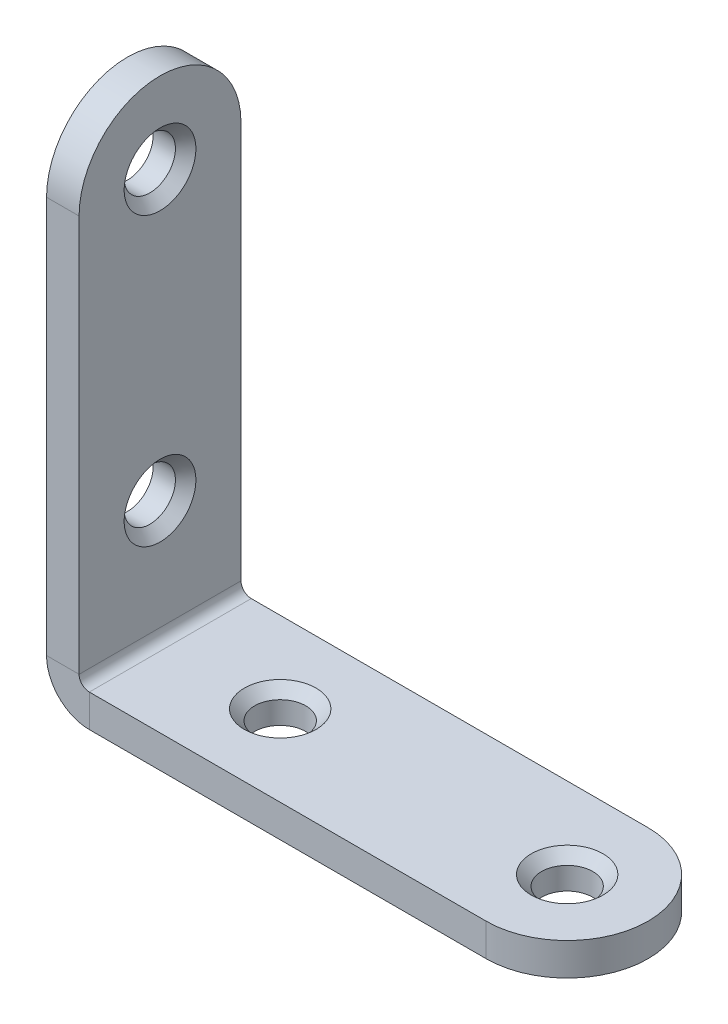
ISO-10303-21;
HEADER;
FILE_DESCRIPTION(('STEP AP214'),'2;1');
FILE_NAME('part.step','',(''),(''),'','','');
FILE_SCHEMA(('AUTOMOTIVE_DESIGN { 1 0 10303 214 1 1 1 1 }'));
ENDSEC;
DATA;
#1=APPLICATION_CONTEXT('core data for automotive mechanical design processes');
#2=APPLICATION_PROTOCOL_DEFINITION('international standard','automotive_design',2000,#1);
#3=PRODUCT_CONTEXT('',#1,'mechanical');
#4=PRODUCT('Part','Part','',(#3));
#5=PRODUCT_RELATED_PRODUCT_CATEGORY('part','',(#4));
#6=PRODUCT_DEFINITION_FORMATION('','',#4);
#7=PRODUCT_DEFINITION_CONTEXT('part definition',#1,'design');
#8=PRODUCT_DEFINITION('design','',#6,#7);
#9=PRODUCT_DEFINITION_SHAPE('','',#8);
#10=(LENGTH_UNIT() NAMED_UNIT(*) SI_UNIT(.MILLI.,.METRE.));
#11=(NAMED_UNIT(*) PLANE_ANGLE_UNIT() SI_UNIT($,.RADIAN.));
#12=(NAMED_UNIT(*) SI_UNIT($,.STERADIAN.) SOLID_ANGLE_UNIT());
#13=UNCERTAINTY_MEASURE_WITH_UNIT(LENGTH_MEASURE(1.E-05),#10,'distance_accuracy_value','');
#14=(GEOMETRIC_REPRESENTATION_CONTEXT(3) GLOBAL_UNCERTAINTY_ASSIGNED_CONTEXT((#13)) GLOBAL_UNIT_ASSIGNED_CONTEXT((#10,
#11,#12)) REPRESENTATION_CONTEXT('',''));
#15=CARTESIAN_POINT('',(0.,0.,0.));
#16=DIRECTION('',(0.,0.,1.));
#17=DIRECTION('',(1.,0.,0.));
#18=AXIS2_PLACEMENT_3D('',#15,#16,#17);
#19=CARTESIAN_POINT('',(42.8999999999999,3.10862446895044E-12,0.));
#20=DIRECTION('',(0.,-1.,0.));
#21=DIRECTION('',(0.,0.,-1.));
#22=AXIS2_PLACEMENT_3D('',#19,#20,#21);
#23=CYLINDRICAL_SURFACE('',#22,7.9);
#24=DIRECTION('',(0.,-1.,0.));
#25=VECTOR('',#24,1.);
#26=CARTESIAN_POINT('',(42.9000000000015,4.17500000000148,7.90000000000001));
#27=LINE('',#26,#25);
#28=CARTESIAN_POINT('',(42.8999999999999,3.10862446895044E-12,7.89999999999998));
#29=VERTEX_POINT('',#28);
#30=CARTESIAN_POINT('',(42.9000000000015,3.17500000000148,7.90000000000005));
#31=VERTEX_POINT('',#30);
#32=EDGE_CURVE('E145',#29,#31,#27,.F.);
#33=ORIENTED_EDGE('',*,*,#32,.F.);
#34=CARTESIAN_POINT('',(42.8999999999999,3.10862446895044E-12,0.));
#35=DIRECTION('',(0.,1.,0.));
#36=DIRECTION('',(0.,0.,1.));
#37=AXIS2_PLACEMENT_3D('',#34,#35,#36);
#38=CIRCLE('',#37,7.9);
#39=CARTESIAN_POINT('',(42.8999999999999,1.55431223447522E-12,-7.90000000000003));
#40=VERTEX_POINT('',#39);
#41=EDGE_CURVE('E70',#40,#29,#38,.F.);
#42=ORIENTED_EDGE('',*,*,#41,.F.);
#43=DIRECTION('',(0.,-1.,0.));
#44=VECTOR('',#43,1.);
#45=CARTESIAN_POINT('',(42.9000000000015,4.17500000000148,-7.89999999999999));
#46=LINE('',#45,#44);
#47=CARTESIAN_POINT('',(42.9000000000015,3.17500000000148,-7.89999999999995));
#48=VERTEX_POINT('',#47);
#49=EDGE_CURVE('E219',#48,#40,#46,.T.);
#50=ORIENTED_EDGE('',*,*,#49,.F.);
#51=CARTESIAN_POINT('',(42.9000000000015,3.17500000000148,0.));
#52=DIRECTION('',(0.,1.,0.));
#53=DIRECTION('',(0.,0.,1.));
#54=AXIS2_PLACEMENT_3D('',#51,#52,#53);
#55=CIRCLE('',#54,7.9);
#56=EDGE_CURVE('E63',#31,#48,#55,.T.);
#57=ORIENTED_EDGE('',*,*,#56,.F.);
#58=EDGE_LOOP('',(#33,#42,#50,#57));
#59=FACE_BOUND('',#58,.T.);
#60=ADVANCED_FACE('F46',(#59),#23,.T.);
#61=CARTESIAN_POINT('',(3.17499999999771,42.9,0.));
#62=DIRECTION('',(1.,0.,0.));
#63=DIRECTION('',(0.,0.,-1.));
#64=AXIS2_PLACEMENT_3D('',#61,#62,#63);
#65=CYLINDRICAL_SURFACE('',#64,7.9);
#66=DIRECTION('',(1.,0.,0.));
#67=VECTOR('',#66,1.);
#68=CARTESIAN_POINT('',(4.17499999999771,42.9,7.90000000000001));
#69=LINE('',#68,#67);
#70=CARTESIAN_POINT('',(3.17499999999771,42.9,7.90000000000005));
#71=VERTEX_POINT('',#70);
#72=CARTESIAN_POINT('',(-2.33146835171283E-12,42.9,7.90000000000005));
#73=VERTEX_POINT('',#72);
#74=EDGE_CURVE('E203',#71,#73,#69,.F.);
#75=ORIENTED_EDGE('',*,*,#74,.F.);
#76=CARTESIAN_POINT('',(3.17499999999771,42.9,0.));
#77=DIRECTION('',(1.,0.,0.));
#78=DIRECTION('',(0.,0.,-1.));
#79=AXIS2_PLACEMENT_3D('',#76,#77,#78);
#80=CIRCLE('',#79,7.9);
#81=CARTESIAN_POINT('',(3.17499999999771,42.9,-7.89999999999995));
#82=VERTEX_POINT('',#81);
#83=EDGE_CURVE('E211',#82,#71,#80,.T.);
#84=ORIENTED_EDGE('',*,*,#83,.F.);
#85=DIRECTION('',(-1.,0.,0.));
#86=VECTOR('',#85,1.);
#87=CARTESIAN_POINT('',(3.17499999999771,42.9,-7.89999999999995));
#88=LINE('',#87,#86);
#89=CARTESIAN_POINT('',(-2.33146835171283E-12,42.9,-7.89999999999995));
#90=VERTEX_POINT('',#89);
#91=EDGE_CURVE('E207',#90,#82,#88,.F.);
#92=ORIENTED_EDGE('',*,*,#91,.F.);
#93=CARTESIAN_POINT('',(-2.33146835171283E-12,42.9,0.));
#94=DIRECTION('',(1.,0.,0.));
#95=DIRECTION('',(0.,0.,-1.));
#96=AXIS2_PLACEMENT_3D('',#93,#94,#95);
#97=CIRCLE('',#96,7.9);
#98=EDGE_CURVE('E214',#73,#90,#97,.F.);
#99=ORIENTED_EDGE('',*,*,#98,.F.);
#100=EDGE_LOOP('',(#75,#84,#92,#99));
#101=FACE_BOUND('',#100,.T.);
#102=ADVANCED_FACE('F313',(#101),#65,.T.);
#103=CARTESIAN_POINT('',(1.55431223447522E-12,4.17500000000004,7.90000000000009));
#104=DIRECTION('',(0.,0.,1.));
#105=DIRECTION('',(1.,0.,0.));
#106=AXIS2_PLACEMENT_3D('',#103,#104,#105);
#107=PLANE('',#106);
#108=DIRECTION('',(1.,0.,0.));
#109=VECTOR('',#108,1.);
#110=CARTESIAN_POINT('',(1.55431223447522E-12,4.17500000000004,7.90000000000009));
#111=LINE('',#110,#109);
#112=CARTESIAN_POINT('',(1.55431223447522E-12,4.17500000000004,7.90000000000009));
#113=VERTEX_POINT('',#112);
#114=CARTESIAN_POINT('',(3.17500000000159,4.17500000000004,7.9));
#115=VERTEX_POINT('',#114);
#116=EDGE_CURVE('E127',#113,#115,#111,.T.);
#117=ORIENTED_EDGE('',*,*,#116,.F.);
#118=CARTESIAN_POINT('',(4.17500000000159,4.17500000000004,7.89999999999998));
#119=DIRECTION('',(0.,0.,-1.));
#120=DIRECTION('',(-1.,0.,0.));
#121=AXIS2_PLACEMENT_3D('',#118,#119,#120);
#122=CIRCLE('',#121,4.175);
#123=CARTESIAN_POINT('',(4.17500000000004,0.,7.90000000000012));
#124=VERTEX_POINT('',#123);
#125=EDGE_CURVE('E121',#113,#124,#122,.F.);
#126=ORIENTED_EDGE('',*,*,#125,.T.);
#127=DIRECTION('',(0.,-1.,0.));
#128=VECTOR('',#127,1.);
#129=CARTESIAN_POINT('',(4.17500000000159,3.17500000000004,7.9));
#130=LINE('',#129,#128);
#131=CARTESIAN_POINT('',(4.17500000000159,3.17500000000004,7.9));
#132=VERTEX_POINT('',#131);
#133=EDGE_CURVE('E114',#132,#124,#130,.T.);
#134=ORIENTED_EDGE('',*,*,#133,.F.);
#135=CARTESIAN_POINT('',(4.17500000000159,4.17500000000004,7.89999999999998));
#136=DIRECTION('',(0.,0.,1.));
#137=DIRECTION('',(1.,0.,0.));
#138=AXIS2_PLACEMENT_3D('',#135,#136,#137);
#139=CIRCLE('',#138,1.);
#140=EDGE_CURVE('E119',#115,#132,#139,.T.);
#141=ORIENTED_EDGE('',*,*,#140,.F.);
#142=EDGE_LOOP('',(#117,#126,#134,#141));
#143=FACE_BOUND('',#142,.T.);
#144=ADVANCED_FACE('F117',(#143),#107,.T.);
#145=CARTESIAN_POINT('',(4.17500000000159,3.17500000000004,7.9));
#146=DIRECTION('',(0.,0.,1.));
#147=DIRECTION('',(1.,0.,0.));
#148=AXIS2_PLACEMENT_3D('',#145,#146,#147);
#149=PLANE('',#148);
#150=DIRECTION('',(0.,1.,0.));
#151=VECTOR('',#150,1.);
#152=CARTESIAN_POINT('',(3.17500000000004,0.,7.89999999999998));
#153=LINE('',#152,#151);
#154=EDGE_CURVE('E153',#71,#115,#153,.F.);
#155=ORIENTED_EDGE('',*,*,#154,.F.);
#156=ORIENTED_EDGE('',*,*,#74,.T.);
#157=DIRECTION('',(0.,-1.,0.));
#158=VECTOR('',#157,1.);
#159=CARTESIAN_POINT('',(0.,0.,7.90000000000001));
#160=LINE('',#159,#158);
#161=EDGE_CURVE('E157',#73,#113,#160,.T.);
#162=ORIENTED_EDGE('',*,*,#161,.T.);
#163=ORIENTED_EDGE('',*,*,#116,.T.);
#164=EDGE_LOOP('',(#155,#156,#162,#163));
#165=FACE_BOUND('',#164,.T.);
#166=ADVANCED_FACE('F311',(#165),#149,.T.);
#167=CARTESIAN_POINT('',(4.17500000000004,-1.55431223447522E-12,-7.89999999999988));
#168=DIRECTION('',(0.,0.,-1.));
#169=DIRECTION('',(-1.,0.,0.));
#170=AXIS2_PLACEMENT_3D('',#167,#168,#169);
#171=PLANE('',#170);
#172=DIRECTION('',(0.,1.,0.));
#173=VECTOR('',#172,1.);
#174=CARTESIAN_POINT('',(4.17500000000004,-1.55431223447522E-12,-7.89999999999988));
#175=LINE('',#174,#173);
#176=CARTESIAN_POINT('',(4.17500000000004,-1.55431223447522E-12,-7.89999999999988));
#177=VERTEX_POINT('',#176);
#178=CARTESIAN_POINT('',(4.17500000000159,3.17500000000004,-7.9));
#179=VERTEX_POINT('',#178);
#180=EDGE_CURVE('E128',#177,#179,#175,.T.);
#181=ORIENTED_EDGE('',*,*,#180,.F.);
#182=CARTESIAN_POINT('',(4.17500000000159,4.17500000000004,-7.90000000000003));
#183=DIRECTION('',(0.,0.,-1.));
#184=DIRECTION('',(-1.,0.,0.));
#185=AXIS2_PLACEMENT_3D('',#182,#183,#184);
#186=CIRCLE('',#185,4.175);
#187=CARTESIAN_POINT('',(1.55431223447522E-12,4.17500000000004,-7.89999999999992));
#188=VERTEX_POINT('',#187);
#189=EDGE_CURVE('E182',#188,#177,#186,.F.);
#190=ORIENTED_EDGE('',*,*,#189,.F.);
#191=DIRECTION('',(-1.,0.,0.));
#192=VECTOR('',#191,1.);
#193=CARTESIAN_POINT('',(3.17500000000159,4.17500000000004,-7.9));
#194=LINE('',#193,#192);
#195=CARTESIAN_POINT('',(3.17500000000159,4.17500000000004,-7.9));
#196=VERTEX_POINT('',#195);
#197=EDGE_CURVE('E140',#196,#188,#194,.T.);
#198=ORIENTED_EDGE('',*,*,#197,.F.);
#199=CARTESIAN_POINT('',(4.17500000000159,4.17500000000004,-7.90000000000003));
#200=DIRECTION('',(0.,0.,1.));
#201=DIRECTION('',(1.,0.,0.));
#202=AXIS2_PLACEMENT_3D('',#199,#200,#201);
#203=CIRCLE('',#202,1.);
#204=EDGE_CURVE('E173',#196,#179,#203,.T.);
#205=ORIENTED_EDGE('',*,*,#204,.T.);
#206=EDGE_LOOP('',(#181,#190,#198,#205));
#207=FACE_BOUND('',#206,.T.);
#208=ADVANCED_FACE('F294',(#207),#171,.T.);
#209=CARTESIAN_POINT('',(3.17500000000159,4.17500000000004,-7.9));
#210=DIRECTION('',(0.,0.,-1.));
#211=DIRECTION('',(-1.,0.,0.));
#212=AXIS2_PLACEMENT_3D('',#209,#210,#211);
#213=PLANE('',#212);
#214=DIRECTION('',(1.,0.,0.));
#215=VECTOR('',#214,1.);
#216=CARTESIAN_POINT('',(1.55431223447522E-12,3.17500000000004,-7.89999999999995));
#217=LINE('',#216,#215);
#218=EDGE_CURVE('E135',#179,#48,#217,.T.);
#219=ORIENTED_EDGE('',*,*,#218,.T.);
#220=ORIENTED_EDGE('',*,*,#49,.T.);
#221=DIRECTION('',(1.,0.,0.));
#222=VECTOR('',#221,1.);
#223=CARTESIAN_POINT('',(0.,0.,-7.89999999999999));
#224=LINE('',#223,#222);
#225=EDGE_CURVE('E166',#177,#40,#224,.T.);
#226=ORIENTED_EDGE('',*,*,#225,.F.);
#227=ORIENTED_EDGE('',*,*,#180,.T.);
#228=EDGE_LOOP('',(#219,#220,#226,#227));
#229=FACE_BOUND('',#228,.T.);
#230=ADVANCED_FACE('F291',(#229),#213,.T.);
#231=CARTESIAN_POINT('',(0.,0.,7.90000000000001));
#232=DIRECTION('',(0.,1.,0.));
#233=DIRECTION('',(0.,0.,1.));
#234=AXIS2_PLACEMENT_3D('',#231,#232,#233);
#235=PLANE('',#234);
#236=CARTESIAN_POINT('',(42.8999999999999,3.10862446895044E-12,0.));
#237=DIRECTION('',(0.,1.,0.));
#238=DIRECTION('',(0.,0.,1.));
#239=AXIS2_PLACEMENT_3D('',#236,#237,#238);
#240=CIRCLE('',#239,2.5);
#241=CARTESIAN_POINT('',(42.8999999999999,3.10862446895044E-12,2.5));
#242=VERTEX_POINT('',#241);
#243=EDGE_CURVE('E170',#242,#242,#240,.T.);
#244=ORIENTED_EDGE('',*,*,#243,.T.);
#245=EDGE_LOOP('',(#244));
#246=FACE_BOUND('',#245,.T.);
#247=CARTESIAN_POINT('',(14.9,-1.55431223447522E-12,0.));
#248=DIRECTION('',(0.,1.,0.));
#249=DIRECTION('',(0.,0.,1.));
#250=AXIS2_PLACEMENT_3D('',#247,#248,#249);
#251=CIRCLE('',#250,2.5);
#252=CARTESIAN_POINT('',(14.9,-1.55431223447522E-12,2.5));
#253=VERTEX_POINT('',#252);
#254=EDGE_CURVE('E270',#253,#253,#251,.T.);
#255=ORIENTED_EDGE('',*,*,#254,.T.);
#256=EDGE_LOOP('',(#255));
#257=FACE_BOUND('',#256,.T.);
#258=ORIENTED_EDGE('',*,*,#225,.T.);
#259=ORIENTED_EDGE('',*,*,#41,.T.);
#260=DIRECTION('',(1.,0.,0.));
#261=VECTOR('',#260,1.);
#262=CARTESIAN_POINT('',(0.,0.,7.90000000000001));
#263=LINE('',#262,#261);
#264=EDGE_CURVE('E147',#124,#29,#263,.T.);
#265=ORIENTED_EDGE('',*,*,#264,.F.);
#266=DIRECTION('',(0.,0.,-1.));
#267=VECTOR('',#266,1.);
#268=CARTESIAN_POINT('',(4.17500000000004,0.,7.90000000000012));
#269=LINE('',#268,#267);
#270=EDGE_CURVE('E165',#124,#177,#269,.T.);
#271=ORIENTED_EDGE('',*,*,#270,.T.);
#272=EDGE_LOOP('',(#258,#259,#265,#271));
#273=FACE_BOUND('',#272,.T.);
#274=ADVANCED_FACE('F288',(#246,#257,#273),#235,.F.);
#275=CARTESIAN_POINT('',(1.55431223447522E-12,3.17500000000004,7.90000000000005));
#276=DIRECTION('',(0.,1.,0.));
#277=DIRECTION('',(0.,0.,1.));
#278=AXIS2_PLACEMENT_3D('',#275,#276,#277);
#279=PLANE('',#278);
#280=CARTESIAN_POINT('',(14.9000000000016,3.17499999999848,0.));
#281=DIRECTION('',(0.,1.,0.));
#282=DIRECTION('',(0.,0.,1.));
#283=AXIS2_PLACEMENT_3D('',#280,#281,#282);
#284=CIRCLE('',#283,3.5);
#285=CARTESIAN_POINT('',(14.9000000000016,3.17499999999848,3.5));
#286=VERTEX_POINT('',#285);
#287=EDGE_CURVE('E56',#286,#286,#284,.F.);
#288=ORIENTED_EDGE('',*,*,#287,.T.);
#289=EDGE_LOOP('',(#288));
#290=FACE_BOUND('',#289,.T.);
#291=CARTESIAN_POINT('',(42.9000000000015,3.17500000000148,0.));
#292=DIRECTION('',(0.,1.,0.));
#293=DIRECTION('',(0.,0.,1.));
#294=AXIS2_PLACEMENT_3D('',#291,#292,#293);
#295=CIRCLE('',#294,3.5);
#296=CARTESIAN_POINT('',(42.9000000000015,3.17500000000148,3.5));
#297=VERTEX_POINT('',#296);
#298=EDGE_CURVE('E246',#297,#297,#295,.F.);
#299=ORIENTED_EDGE('',*,*,#298,.T.);
#300=EDGE_LOOP('',(#299));
#301=FACE_BOUND('',#300,.T.);
#302=DIRECTION('',(1.,0.,0.));
#303=VECTOR('',#302,1.);
#304=CARTESIAN_POINT('',(1.55431223447522E-12,3.17500000000004,7.90000000000005));
#305=LINE('',#304,#303);
#306=EDGE_CURVE('E133',#132,#31,#305,.T.);
#307=ORIENTED_EDGE('',*,*,#306,.T.);
#308=ORIENTED_EDGE('',*,*,#56,.T.);
#309=ORIENTED_EDGE('',*,*,#218,.F.);
#310=DIRECTION('',(0.,0.,-1.));
#311=VECTOR('',#310,1.);
#312=CARTESIAN_POINT('',(4.17500000000159,3.17500000000004,7.9));
#313=LINE('',#312,#311);
#314=EDGE_CURVE('E131',#132,#179,#313,.T.);
#315=ORIENTED_EDGE('',*,*,#314,.F.);
#316=EDGE_LOOP('',(#307,#308,#309,#315));
#317=FACE_BOUND('',#316,.T.);
#318=ADVANCED_FACE('F132',(#290,#301,#317),#279,.T.);
#319=CARTESIAN_POINT('',(4.17500000000159,4.17500000000004,7.89999999999998));
#320=DIRECTION('',(0.,0.,-1.));
#321=DIRECTION('',(-1.,0.,0.));
#322=AXIS2_PLACEMENT_3D('',#319,#320,#321);
#323=CYLINDRICAL_SURFACE('',#322,1.);
#324=ORIENTED_EDGE('',*,*,#204,.F.);
#325=DIRECTION('',(0.,0.,-1.));
#326=VECTOR('',#325,1.);
#327=CARTESIAN_POINT('',(3.17500000000159,4.17500000000004,7.9));
#328=LINE('',#327,#326);
#329=EDGE_CURVE('E141',#115,#196,#328,.T.);
#330=ORIENTED_EDGE('',*,*,#329,.F.);
#331=ORIENTED_EDGE('',*,*,#140,.T.);
#332=ORIENTED_EDGE('',*,*,#314,.T.);
#333=EDGE_LOOP('',(#324,#330,#331,#332));
#334=FACE_BOUND('',#333,.T.);
#335=ADVANCED_FACE('F150',(#334),#323,.F.);
#336=CARTESIAN_POINT('',(3.17500000000004,0.,7.89999999999998));
#337=DIRECTION('',(1.,0.,0.));
#338=DIRECTION('',(0.,0.,-1.));
#339=AXIS2_PLACEMENT_3D('',#336,#337,#338);
#340=PLANE('',#339);
#341=CARTESIAN_POINT('',(3.17499999999771,42.9,0.));
#342=DIRECTION('',(1.,0.,0.));
#343=DIRECTION('',(0.,0.,-1.));
#344=AXIS2_PLACEMENT_3D('',#341,#342,#343);
#345=CIRCLE('',#344,3.5);
#346=CARTESIAN_POINT('',(3.17499999999771,42.9,-3.5));
#347=VERTEX_POINT('',#346);
#348=EDGE_CURVE('E234',#347,#347,#345,.F.);
#349=ORIENTED_EDGE('',*,*,#348,.T.);
#350=EDGE_LOOP('',(#349));
#351=FACE_BOUND('',#350,.T.);
#352=CARTESIAN_POINT('',(3.17500000000381,14.9,0.));
#353=DIRECTION('',(1.,0.,0.));
#354=DIRECTION('',(0.,0.,-1.));
#355=AXIS2_PLACEMENT_3D('',#352,#353,#354);
#356=CIRCLE('',#355,3.5);
#357=CARTESIAN_POINT('',(3.17500000000381,14.9,-3.5));
#358=VERTEX_POINT('',#357);
#359=EDGE_CURVE('E230',#358,#358,#356,.F.);
#360=ORIENTED_EDGE('',*,*,#359,.T.);
#361=EDGE_LOOP('',(#360));
#362=FACE_BOUND('',#361,.T.);
#363=DIRECTION('',(0.,1.,0.));
#364=VECTOR('',#363,1.);
#365=CARTESIAN_POINT('',(3.17500000000004,-1.55431223447522E-12,-7.90000000000003));
#366=LINE('',#365,#364);
#367=EDGE_CURVE('E176',#82,#196,#366,.F.);
#368=ORIENTED_EDGE('',*,*,#367,.F.);
#369=ORIENTED_EDGE('',*,*,#83,.T.);
#370=ORIENTED_EDGE('',*,*,#154,.T.);
#371=ORIENTED_EDGE('',*,*,#329,.T.);
#372=EDGE_LOOP('',(#368,#369,#370,#371));
#373=FACE_BOUND('',#372,.T.);
#374=ADVANCED_FACE('F307',(#351,#362,#373),#340,.T.);
#375=CARTESIAN_POINT('',(0.,0.,7.90000000000001));
#376=DIRECTION('',(1.,0.,0.));
#377=DIRECTION('',(0.,0.,-1.));
#378=AXIS2_PLACEMENT_3D('',#375,#376,#377);
#379=PLANE('',#378);
#380=CARTESIAN_POINT('',(-2.33146835171283E-12,42.9,0.));
#381=DIRECTION('',(1.,0.,0.));
#382=DIRECTION('',(0.,0.,-1.));
#383=AXIS2_PLACEMENT_3D('',#380,#381,#382);
#384=CIRCLE('',#383,2.5);
#385=CARTESIAN_POINT('',(-2.33146835171283E-12,42.9,-2.5));
#386=VERTEX_POINT('',#385);
#387=EDGE_CURVE('E273',#386,#386,#384,.T.);
#388=ORIENTED_EDGE('',*,*,#387,.T.);
#389=EDGE_LOOP('',(#388));
#390=FACE_BOUND('',#389,.T.);
#391=CARTESIAN_POINT('',(3.88578058618805E-12,14.9,0.));
#392=DIRECTION('',(1.,0.,0.));
#393=DIRECTION('',(0.,0.,-1.));
#394=AXIS2_PLACEMENT_3D('',#391,#392,#393);
#395=CIRCLE('',#394,2.5);
#396=CARTESIAN_POINT('',(3.88578058618805E-12,14.9,-2.5));
#397=VERTEX_POINT('',#396);
#398=EDGE_CURVE('E281',#397,#397,#395,.T.);
#399=ORIENTED_EDGE('',*,*,#398,.T.);
#400=EDGE_LOOP('',(#399));
#401=FACE_BOUND('',#400,.T.);
#402=ORIENTED_EDGE('',*,*,#161,.F.);
#403=ORIENTED_EDGE('',*,*,#98,.T.);
#404=DIRECTION('',(0.,-1.,0.));
#405=VECTOR('',#404,1.);
#406=CARTESIAN_POINT('',(0.,0.,-7.89999999999999));
#407=LINE('',#406,#405);
#408=EDGE_CURVE('E179',#90,#188,#407,.T.);
#409=ORIENTED_EDGE('',*,*,#408,.T.);
#410=DIRECTION('',(0.,0.,-1.));
#411=VECTOR('',#410,1.);
#412=CARTESIAN_POINT('',(1.55431223447522E-12,4.17500000000004,7.90000000000009));
#413=LINE('',#412,#411);
#414=EDGE_CURVE('E189',#113,#188,#413,.T.);
#415=ORIENTED_EDGE('',*,*,#414,.F.);
#416=EDGE_LOOP('',(#402,#403,#409,#415));
#417=FACE_BOUND('',#416,.T.);
#418=ADVANCED_FACE('F301',(#390,#401,#417),#379,.F.);
#419=CARTESIAN_POINT('',(4.17500000000159,4.17500000000004,7.89999999999998));
#420=DIRECTION('',(0.,0.,-1.));
#421=DIRECTION('',(-1.,0.,0.));
#422=AXIS2_PLACEMENT_3D('',#419,#420,#421);
#423=CYLINDRICAL_SURFACE('',#422,4.175);
#424=ORIENTED_EDGE('',*,*,#189,.T.);
#425=ORIENTED_EDGE('',*,*,#270,.F.);
#426=ORIENTED_EDGE('',*,*,#125,.F.);
#427=ORIENTED_EDGE('',*,*,#414,.T.);
#428=EDGE_LOOP('',(#424,#425,#426,#427));
#429=FACE_BOUND('',#428,.T.);
#430=ADVANCED_FACE('F297',(#429),#423,.T.);
#431=CARTESIAN_POINT('',(4.17500000000159,4.17500000000004,7.89999999999998));
#432=DIRECTION('',(0.,0.,1.));
#433=DIRECTION('',(1.,0.,0.));
#434=AXIS2_PLACEMENT_3D('',#431,#432,#433);
#435=PLANE('',#434);
#436=ORIENTED_EDGE('',*,*,#264,.T.);
#437=ORIENTED_EDGE('',*,*,#32,.T.);
#438=ORIENTED_EDGE('',*,*,#306,.F.);
#439=ORIENTED_EDGE('',*,*,#133,.T.);
#440=EDGE_LOOP('',(#436,#437,#438,#439));
#441=FACE_BOUND('',#440,.T.);
#442=ADVANCED_FACE('F144',(#441),#435,.T.);
#443=CARTESIAN_POINT('',(4.17500000000159,4.17500000000004,-7.90000000000003));
#444=DIRECTION('',(0.,0.,1.));
#445=DIRECTION('',(1.,0.,0.));
#446=AXIS2_PLACEMENT_3D('',#443,#444,#445);
#447=PLANE('',#446);
#448=ORIENTED_EDGE('',*,*,#408,.F.);
#449=ORIENTED_EDGE('',*,*,#91,.T.);
#450=ORIENTED_EDGE('',*,*,#367,.T.);
#451=ORIENTED_EDGE('',*,*,#197,.T.);
#452=EDGE_LOOP('',(#448,#449,#450,#451));
#453=FACE_BOUND('',#452,.T.);
#454=ADVANCED_FACE('F266',(#453),#447,.F.);
#455=CARTESIAN_POINT('',(14.9,-1.55431223447522E-12,0.));
#456=DIRECTION('',(0.,1.,0.));
#457=DIRECTION('',(0.,0.,1.));
#458=AXIS2_PLACEMENT_3D('',#455,#456,#457);
#459=CYLINDRICAL_SURFACE('',#458,2.5);
#460=CARTESIAN_POINT('',(14.9000000000016,2.17499999999848,0.));
#461=DIRECTION('',(0.,1.,0.));
#462=DIRECTION('',(0.,0.,1.));
#463=AXIS2_PLACEMENT_3D('',#460,#461,#462);
#464=CIRCLE('',#463,2.5);
#465=CARTESIAN_POINT('',(14.9000000000016,2.17499999999848,2.5));
#466=VERTEX_POINT('',#465);
#467=EDGE_CURVE('E242',#466,#466,#464,.T.);
#468=ORIENTED_EDGE('',*,*,#467,.T.);
#469=EDGE_LOOP('',(#468));
#470=FACE_BOUND('',#469,.T.);
#471=ORIENTED_EDGE('',*,*,#254,.F.);
#472=EDGE_LOOP('',(#471));
#473=FACE_BOUND('',#472,.T.);
#474=ADVANCED_FACE('F262',(#470,#473),#459,.F.);
#475=CARTESIAN_POINT('',(42.8999999999999,3.10862446895044E-12,0.));
#476=DIRECTION('',(0.,1.,0.));
#477=DIRECTION('',(0.,0.,1.));
#478=AXIS2_PLACEMENT_3D('',#475,#476,#477);
#479=CYLINDRICAL_SURFACE('',#478,2.5);
#480=CARTESIAN_POINT('',(42.9000000000015,2.17500000000304,0.));
#481=DIRECTION('',(0.,1.,0.));
#482=DIRECTION('',(0.,0.,1.));
#483=AXIS2_PLACEMENT_3D('',#480,#481,#482);
#484=CIRCLE('',#483,2.5);
#485=CARTESIAN_POINT('',(42.9000000000015,2.17500000000304,2.5));
#486=VERTEX_POINT('',#485);
#487=EDGE_CURVE('E11',#486,#486,#484,.T.);
#488=ORIENTED_EDGE('',*,*,#487,.T.);
#489=EDGE_LOOP('',(#488));
#490=FACE_BOUND('',#489,.T.);
#491=ORIENTED_EDGE('',*,*,#243,.F.);
#492=EDGE_LOOP('',(#491));
#493=FACE_BOUND('',#492,.T.);
#494=ADVANCED_FACE('F265',(#490,#493),#479,.F.);
#495=CARTESIAN_POINT('',(3.88578058618805E-12,14.9,0.));
#496=DIRECTION('',(1.,0.,0.));
#497=DIRECTION('',(0.,0.,-1.));
#498=AXIS2_PLACEMENT_3D('',#495,#496,#497);
#499=CYLINDRICAL_SURFACE('',#498,2.5);
#500=CARTESIAN_POINT('',(2.17500000000381,14.9,0.));
#501=DIRECTION('',(1.,0.,0.));
#502=DIRECTION('',(0.,0.,-1.));
#503=AXIS2_PLACEMENT_3D('',#500,#501,#502);
#504=CIRCLE('',#503,2.5);
#505=CARTESIAN_POINT('',(2.17500000000381,14.9,-2.5));
#506=VERTEX_POINT('',#505);
#507=EDGE_CURVE('E238',#506,#506,#504,.T.);
#508=ORIENTED_EDGE('',*,*,#507,.T.);
#509=EDGE_LOOP('',(#508));
#510=FACE_BOUND('',#509,.T.);
#511=ORIENTED_EDGE('',*,*,#398,.F.);
#512=EDGE_LOOP('',(#511));
#513=FACE_BOUND('',#512,.T.);
#514=ADVANCED_FACE('F354',(#510,#513),#499,.F.);
#515=CARTESIAN_POINT('',(-2.33146835171283E-12,42.9,0.));
#516=DIRECTION('',(1.,0.,0.));
#517=DIRECTION('',(0.,0.,-1.));
#518=AXIS2_PLACEMENT_3D('',#515,#516,#517);
#519=CYLINDRICAL_SURFACE('',#518,2.5);
#520=CARTESIAN_POINT('',(2.17499999999771,42.9,0.));
#521=DIRECTION('',(1.,0.,0.));
#522=DIRECTION('',(0.,0.,-1.));
#523=AXIS2_PLACEMENT_3D('',#520,#521,#522);
#524=CIRCLE('',#523,2.5);
#525=CARTESIAN_POINT('',(2.17499999999771,42.9,-2.5));
#526=VERTEX_POINT('',#525);
#527=EDGE_CURVE('E226',#526,#526,#524,.T.);
#528=ORIENTED_EDGE('',*,*,#527,.T.);
#529=EDGE_LOOP('',(#528));
#530=FACE_BOUND('',#529,.T.);
#531=ORIENTED_EDGE('',*,*,#387,.F.);
#532=EDGE_LOOP('',(#531));
#533=FACE_BOUND('',#532,.T.);
#534=ADVANCED_FACE('F337',(#530,#533),#519,.F.);
#535=CARTESIAN_POINT('',(2.17499999999771,42.9,0.));
#536=DIRECTION('',(1.,0.,0.));
#537=DIRECTION('',(0.,0.,-1.));
#538=AXIS2_PLACEMENT_3D('',#535,#536,#537);
#539=CONICAL_SURFACE('',#538,2.5,0.785398163397451);
#540=ORIENTED_EDGE('',*,*,#348,.F.);
#541=EDGE_LOOP('',(#540));
#542=FACE_BOUND('',#541,.T.);
#543=ORIENTED_EDGE('',*,*,#527,.F.);
#544=EDGE_LOOP('',(#543));
#545=FACE_BOUND('',#544,.T.);
#546=ADVANCED_FACE('F331',(#542,#545),#539,.F.);
#547=CARTESIAN_POINT('',(2.17500000000381,14.9,0.));
#548=DIRECTION('',(1.,0.,0.));
#549=DIRECTION('',(0.,0.,-1.));
#550=AXIS2_PLACEMENT_3D('',#547,#548,#549);
#551=CONICAL_SURFACE('',#550,2.5,0.785398163397447);
#552=ORIENTED_EDGE('',*,*,#359,.F.);
#553=EDGE_LOOP('',(#552));
#554=FACE_BOUND('',#553,.T.);
#555=ORIENTED_EDGE('',*,*,#507,.F.);
#556=EDGE_LOOP('',(#555));
#557=FACE_BOUND('',#556,.T.);
#558=ADVANCED_FACE('F259',(#554,#557),#551,.F.);
#559=CARTESIAN_POINT('',(14.9000000000016,2.17499999999848,0.));
#560=DIRECTION('',(0.,1.,0.));
#561=DIRECTION('',(0.,0.,1.));
#562=AXIS2_PLACEMENT_3D('',#559,#560,#561);
#563=CONICAL_SURFACE('',#562,2.5,0.785398163397447);
#564=ORIENTED_EDGE('',*,*,#287,.F.);
#565=EDGE_LOOP('',(#564));
#566=FACE_BOUND('',#565,.T.);
#567=ORIENTED_EDGE('',*,*,#467,.F.);
#568=EDGE_LOOP('',(#567));
#569=FACE_BOUND('',#568,.T.);
#570=ADVANCED_FACE('F256',(#566,#569),#563,.F.);
#571=CARTESIAN_POINT('',(42.9000000000015,2.17500000000304,0.));
#572=DIRECTION('',(0.,1.,0.));
#573=DIRECTION('',(0.,0.,1.));
#574=AXIS2_PLACEMENT_3D('',#571,#572,#573);
#575=CONICAL_SURFACE('',#574,2.5,0.785398163397447);
#576=ORIENTED_EDGE('',*,*,#298,.F.);
#577=EDGE_LOOP('',(#576));
#578=FACE_BOUND('',#577,.T.);
#579=ORIENTED_EDGE('',*,*,#487,.F.);
#580=EDGE_LOOP('',(#579));
#581=FACE_BOUND('',#580,.T.);
#582=ADVANCED_FACE('F49',(#578,#581),#575,.F.);
#583=CLOSED_SHELL('',(#60,#102,#144,#166,#208,#230,#274,#318,#335,#374,#418,#430,#442,#454,#474,
#494,#514,#534,#546,#558,#570,#582));
#584=MANIFOLD_SOLID_BREP('B2',#583);
#585=ADVANCED_BREP_SHAPE_REPRESENTATION('',(#18,#584),#14);
#586=SHAPE_DEFINITION_REPRESENTATION(#9,#585);
ENDSEC;
END-ISO-10303-21;
